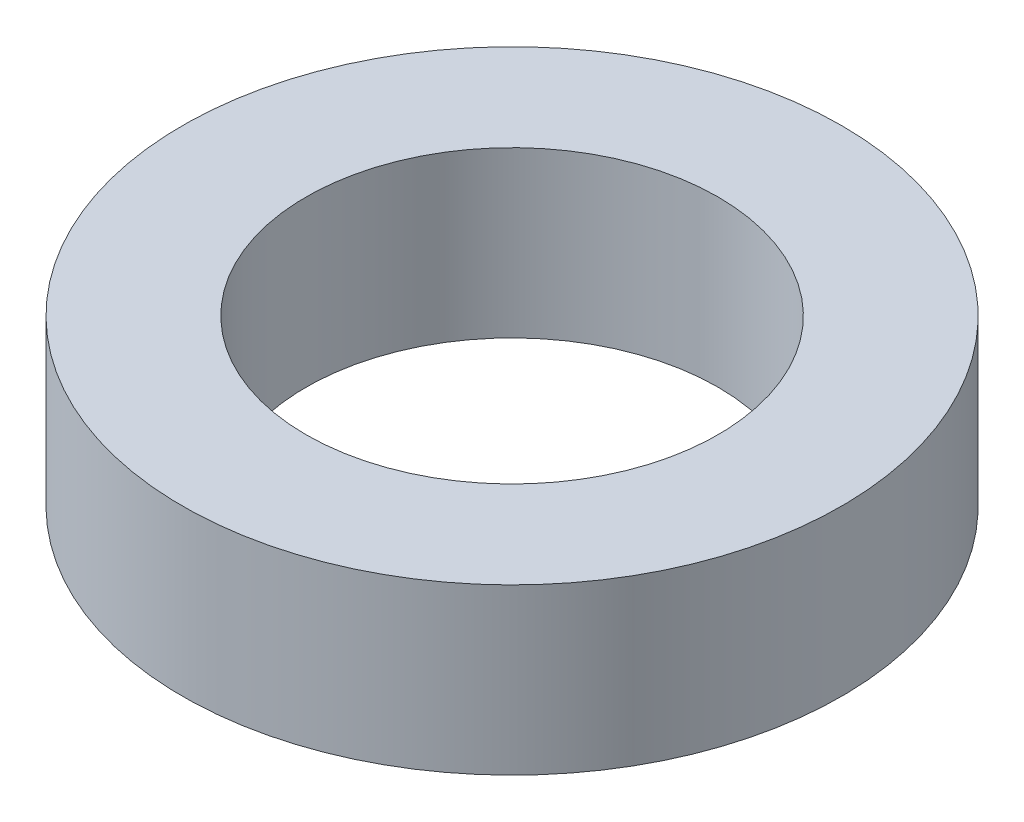
ISO-10303-21;
HEADER;
FILE_DESCRIPTION(('STEP AP214'),'2;1');
FILE_NAME('part.step','',(''),(''),'','','');
FILE_SCHEMA(('AUTOMOTIVE_DESIGN { 1 0 10303 214 1 1 1 1 }'));
ENDSEC;
DATA;
#1=APPLICATION_CONTEXT('core data for automotive mechanical design processes');
#2=APPLICATION_PROTOCOL_DEFINITION('international standard','automotive_design',2000,#1);
#3=PRODUCT_CONTEXT('',#1,'mechanical');
#4=PRODUCT('Part','Part','',(#3));
#5=PRODUCT_RELATED_PRODUCT_CATEGORY('part','',(#4));
#6=PRODUCT_DEFINITION_FORMATION('','',#4);
#7=PRODUCT_DEFINITION_CONTEXT('part definition',#1,'design');
#8=PRODUCT_DEFINITION('design','',#6,#7);
#9=PRODUCT_DEFINITION_SHAPE('','',#8);
#10=(LENGTH_UNIT() NAMED_UNIT(*) SI_UNIT(.MILLI.,.METRE.));
#11=(NAMED_UNIT(*) PLANE_ANGLE_UNIT() SI_UNIT($,.RADIAN.));
#12=(NAMED_UNIT(*) SI_UNIT($,.STERADIAN.) SOLID_ANGLE_UNIT());
#13=UNCERTAINTY_MEASURE_WITH_UNIT(LENGTH_MEASURE(1.E-05),#10,'distance_accuracy_value','');
#14=(GEOMETRIC_REPRESENTATION_CONTEXT(3) GLOBAL_UNCERTAINTY_ASSIGNED_CONTEXT((#13)) GLOBAL_UNIT_ASSIGNED_CONTEXT((#10,
#11,#12)) REPRESENTATION_CONTEXT('',''));
#15=CARTESIAN_POINT('',(0.,0.,0.));
#16=DIRECTION('',(0.,0.,1.));
#17=DIRECTION('',(1.,0.,0.));
#18=AXIS2_PLACEMENT_3D('',#15,#16,#17);
#19=CARTESIAN_POINT('',(0.,0.,0.));
#20=DIRECTION('',(0.,-1.,0.));
#21=DIRECTION('',(0.,0.,-1.));
#22=AXIS2_PLACEMENT_3D('',#19,#20,#21);
#23=CYLINDRICAL_SURFACE('',#22,2.25);
#24=CARTESIAN_POINT('',(0.,0.,0.));
#25=DIRECTION('',(0.,-1.,0.));
#26=DIRECTION('',(0.,0.,-1.));
#27=AXIS2_PLACEMENT_3D('',#24,#25,#26);
#28=CIRCLE('',#27,2.25);
#29=CARTESIAN_POINT('',(0.,0.,-2.25));
#30=VERTEX_POINT('',#29);
#31=EDGE_CURVE('E10',#30,#30,#28,.T.);
#32=ORIENTED_EDGE('',*,*,#31,.T.);
#33=EDGE_LOOP('',(#32));
#34=FACE_BOUND('',#33,.T.);
#35=CARTESIAN_POINT('',(0.,1.8,0.));
#36=DIRECTION('',(0.,-1.,0.));
#37=DIRECTION('',(0.,0.,-1.));
#38=AXIS2_PLACEMENT_3D('',#35,#36,#37);
#39=CIRCLE('',#38,2.25);
#40=CARTESIAN_POINT('',(0.,1.8,-2.25));
#41=VERTEX_POINT('',#40);
#42=EDGE_CURVE('E43',#41,#41,#39,.T.);
#43=ORIENTED_EDGE('',*,*,#42,.F.);
#44=EDGE_LOOP('',(#43));
#45=FACE_BOUND('',#44,.T.);
#46=ADVANCED_FACE('F29',(#34,#45),#23,.F.);
#47=CARTESIAN_POINT('',(2.25,0.,0.));
#48=DIRECTION('',(0.,-1.,0.));
#49=DIRECTION('',(0.,0.,-1.));
#50=AXIS2_PLACEMENT_3D('',#47,#48,#49);
#51=PLANE('',#50);
#52=CARTESIAN_POINT('',(0.,0.,0.));
#53=DIRECTION('',(0.,-1.,0.));
#54=DIRECTION('',(0.,0.,-1.));
#55=AXIS2_PLACEMENT_3D('',#52,#53,#54);
#56=CIRCLE('',#55,3.6);
#57=CARTESIAN_POINT('',(0.,0.,-3.6));
#58=VERTEX_POINT('',#57);
#59=EDGE_CURVE('E35',#58,#58,#56,.T.);
#60=ORIENTED_EDGE('',*,*,#59,.T.);
#61=EDGE_LOOP('',(#60));
#62=FACE_BOUND('',#61,.T.);
#63=ORIENTED_EDGE('',*,*,#31,.F.);
#64=EDGE_LOOP('',(#63));
#65=FACE_BOUND('',#64,.T.);
#66=ADVANCED_FACE('F53',(#62,#65),#51,.T.);
#67=CARTESIAN_POINT('',(0.,0.,0.));
#68=DIRECTION('',(0.,-1.,0.));
#69=DIRECTION('',(0.,0.,-1.));
#70=AXIS2_PLACEMENT_3D('',#67,#68,#69);
#71=CYLINDRICAL_SURFACE('',#70,3.6);
#72=CARTESIAN_POINT('',(0.,1.8,0.));
#73=DIRECTION('',(0.,-1.,0.));
#74=DIRECTION('',(0.,0.,-1.));
#75=AXIS2_PLACEMENT_3D('',#72,#73,#74);
#76=CIRCLE('',#75,3.6);
#77=CARTESIAN_POINT('',(0.,1.8,-3.6));
#78=VERTEX_POINT('',#77);
#79=EDGE_CURVE('E39',#78,#78,#76,.T.);
#80=ORIENTED_EDGE('',*,*,#79,.T.);
#81=EDGE_LOOP('',(#80));
#82=FACE_BOUND('',#81,.T.);
#83=ORIENTED_EDGE('',*,*,#59,.F.);
#84=EDGE_LOOP('',(#83));
#85=FACE_BOUND('',#84,.T.);
#86=ADVANCED_FACE('F57',(#82,#85),#71,.T.);
#87=CARTESIAN_POINT('',(3.6,1.8,0.));
#88=DIRECTION('',(0.,1.,0.));
#89=DIRECTION('',(0.,0.,1.));
#90=AXIS2_PLACEMENT_3D('',#87,#88,#89);
#91=PLANE('',#90);
#92=ORIENTED_EDGE('',*,*,#42,.T.);
#93=EDGE_LOOP('',(#92));
#94=FACE_BOUND('',#93,.T.);
#95=ORIENTED_EDGE('',*,*,#79,.F.);
#96=EDGE_LOOP('',(#95));
#97=FACE_BOUND('',#96,.T.);
#98=ADVANCED_FACE('F49',(#94,#97),#91,.T.);
#99=CLOSED_SHELL('',(#46,#66,#86,#98));
#100=MANIFOLD_SOLID_BREP('B2',#99);
#101=ADVANCED_BREP_SHAPE_REPRESENTATION('',(#18,#100),#14);
#102=SHAPE_DEFINITION_REPRESENTATION(#9,#101);
ENDSEC;
END-ISO-10303-21;
